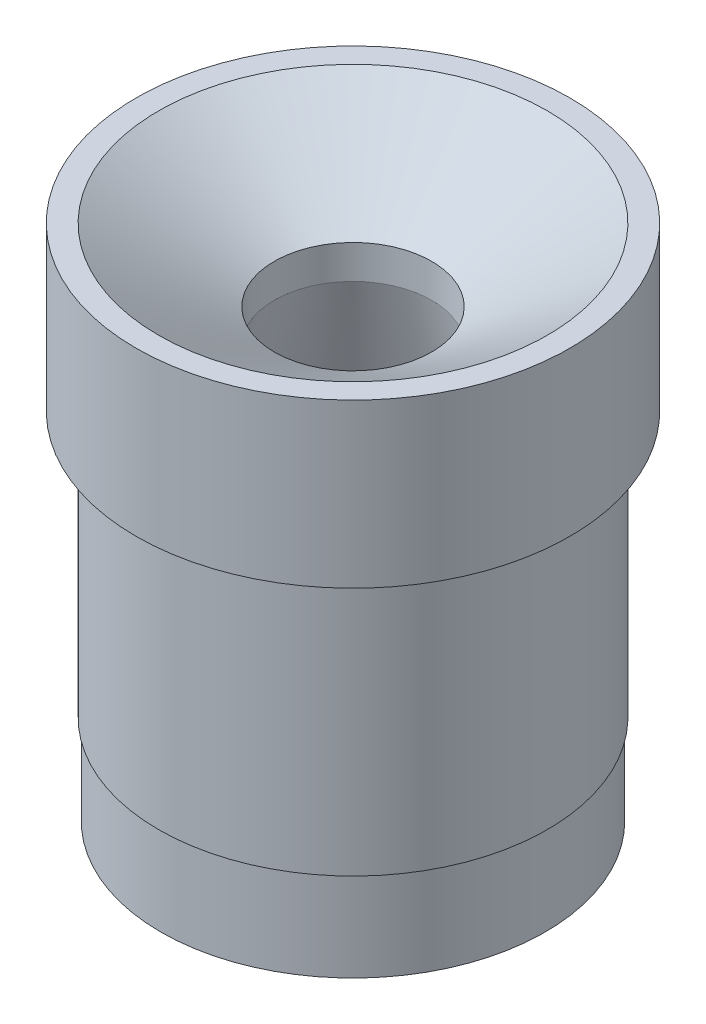
ISO-10303-21;
HEADER;
FILE_DESCRIPTION(('STEP AP214'),'2;1');
FILE_NAME('part.step','',(''),(''),'','','');
FILE_SCHEMA(('AUTOMOTIVE_DESIGN { 1 0 10303 214 1 1 1 1 }'));
ENDSEC;
DATA;
#1=APPLICATION_CONTEXT('core data for automotive mechanical design processes');
#2=APPLICATION_PROTOCOL_DEFINITION('international standard','automotive_design',2000,#1);
#3=PRODUCT_CONTEXT('',#1,'mechanical');
#4=PRODUCT('Part','Part','',(#3));
#5=PRODUCT_RELATED_PRODUCT_CATEGORY('part','',(#4));
#6=PRODUCT_DEFINITION_FORMATION('','',#4);
#7=PRODUCT_DEFINITION_CONTEXT('part definition',#1,'design');
#8=PRODUCT_DEFINITION('design','',#6,#7);
#9=PRODUCT_DEFINITION_SHAPE('','',#8);
#10=(LENGTH_UNIT() NAMED_UNIT(*) SI_UNIT(.MILLI.,.METRE.));
#11=(NAMED_UNIT(*) PLANE_ANGLE_UNIT() SI_UNIT($,.RADIAN.));
#12=(NAMED_UNIT(*) SI_UNIT($,.STERADIAN.) SOLID_ANGLE_UNIT());
#13=UNCERTAINTY_MEASURE_WITH_UNIT(LENGTH_MEASURE(1.E-05),#10,'distance_accuracy_value','');
#14=(GEOMETRIC_REPRESENTATION_CONTEXT(3) GLOBAL_UNCERTAINTY_ASSIGNED_CONTEXT((#13)) GLOBAL_UNIT_ASSIGNED_CONTEXT((#10,
#11,#12)) REPRESENTATION_CONTEXT('',''));
#15=CARTESIAN_POINT('',(0.,0.,0.));
#16=DIRECTION('',(0.,0.,1.));
#17=DIRECTION('',(1.,0.,0.));
#18=AXIS2_PLACEMENT_3D('',#15,#16,#17);
#19=CARTESIAN_POINT('',(0.,0.,-24.511));
#20=DIRECTION('',(0.,1.,0.));
#21=DIRECTION('',(0.,0.,1.));
#22=AXIS2_PLACEMENT_3D('',#19,#20,#21);
#23=PLANE('',#22);
#24=CARTESIAN_POINT('',(0.,0.,0.));
#25=DIRECTION('',(0.,1.,0.));
#26=DIRECTION('',(0.,0.,1.));
#27=AXIS2_PLACEMENT_3D('',#24,#25,#26);
#28=CIRCLE('',#27,24.511);
#29=CARTESIAN_POINT('',(0.,0.,24.511));
#30=VERTEX_POINT('',#29);
#31=EDGE_CURVE('E80',#30,#30,#28,.T.);
#32=ORIENTED_EDGE('',*,*,#31,.F.);
#33=EDGE_LOOP('',(#32));
#34=FACE_BOUND('',#33,.T.);
#35=CARTESIAN_POINT('',(0.,0.,0.));
#36=DIRECTION('',(0.,1.,0.));
#37=DIRECTION('',(0.,0.,1.));
#38=AXIS2_PLACEMENT_3D('',#35,#36,#37);
#39=CIRCLE('',#38,21.971);
#40=CARTESIAN_POINT('',(0.,0.,21.971));
#41=VERTEX_POINT('',#40);
#42=EDGE_CURVE('E10',#41,#41,#39,.T.);
#43=ORIENTED_EDGE('',*,*,#42,.T.);
#44=EDGE_LOOP('',(#43));
#45=FACE_BOUND('',#44,.T.);
#46=ADVANCED_FACE('F37',(#34,#45),#23,.F.);
#47=CARTESIAN_POINT('',(0.,21.55825,0.));
#48=DIRECTION('',(0.,1.,0.));
#49=DIRECTION('',(0.,0.,1.));
#50=AXIS2_PLACEMENT_3D('',#47,#48,#49);
#51=CYLINDRICAL_SURFACE('',#50,21.971);
#52=ORIENTED_EDGE('',*,*,#42,.F.);
#53=EDGE_LOOP('',(#52));
#54=FACE_BOUND('',#53,.T.);
#55=CARTESIAN_POINT('',(0.,-29.972,0.));
#56=DIRECTION('',(0.,1.,0.));
#57=DIRECTION('',(0.,0.,1.));
#58=AXIS2_PLACEMENT_3D('',#55,#56,#57);
#59=CIRCLE('',#58,21.971);
#60=CARTESIAN_POINT('',(0.,-29.972,21.971));
#61=VERTEX_POINT('',#60);
#62=EDGE_CURVE('E44',#61,#61,#59,.T.);
#63=ORIENTED_EDGE('',*,*,#62,.T.);
#64=EDGE_LOOP('',(#63));
#65=FACE_BOUND('',#64,.T.);
#66=ADVANCED_FACE('F88',(#54,#65),#51,.T.);
#67=CARTESIAN_POINT('',(0.,-29.972,-21.717));
#68=DIRECTION('',(0.,1.,0.));
#69=DIRECTION('',(0.,0.,1.));
#70=AXIS2_PLACEMENT_3D('',#67,#68,#69);
#71=PLANE('',#70);
#72=ORIENTED_EDGE('',*,*,#62,.F.);
#73=EDGE_LOOP('',(#72));
#74=FACE_BOUND('',#73,.T.);
#75=CARTESIAN_POINT('',(0.,-29.972,0.));
#76=DIRECTION('',(0.,1.,0.));
#77=DIRECTION('',(0.,0.,1.));
#78=AXIS2_PLACEMENT_3D('',#75,#76,#77);
#79=CIRCLE('',#78,21.717);
#80=CARTESIAN_POINT('',(0.,-29.972,21.717));
#81=VERTEX_POINT('',#80);
#82=EDGE_CURVE('E49',#81,#81,#79,.T.);
#83=ORIENTED_EDGE('',*,*,#82,.T.);
#84=EDGE_LOOP('',(#83));
#85=FACE_BOUND('',#84,.T.);
#86=ADVANCED_FACE('F92',(#74,#85),#71,.F.);
#87=CARTESIAN_POINT('',(0.,21.55825,0.));
#88=DIRECTION('',(0.,1.,0.));
#89=DIRECTION('',(0.,0.,1.));
#90=AXIS2_PLACEMENT_3D('',#87,#88,#89);
#91=CYLINDRICAL_SURFACE('',#90,21.717);
#92=ORIENTED_EDGE('',*,*,#82,.F.);
#93=EDGE_LOOP('',(#92));
#94=FACE_BOUND('',#93,.T.);
#95=CARTESIAN_POINT('',(0.,-40.132,0.));
#96=DIRECTION('',(0.,1.,0.));
#97=DIRECTION('',(0.,0.,1.));
#98=AXIS2_PLACEMENT_3D('',#95,#96,#97);
#99=CIRCLE('',#98,21.717);
#100=CARTESIAN_POINT('',(0.,-40.132,21.717));
#101=VERTEX_POINT('',#100);
#102=EDGE_CURVE('E54',#101,#101,#99,.T.);
#103=ORIENTED_EDGE('',*,*,#102,.T.);
#104=EDGE_LOOP('',(#103));
#105=FACE_BOUND('',#104,.T.);
#106=ADVANCED_FACE('F97',(#94,#105),#91,.T.);
#107=CARTESIAN_POINT('',(0.,-40.132,-21.717));
#108=DIRECTION('',(0.,1.,0.));
#109=DIRECTION('',(0.,0.,1.));
#110=AXIS2_PLACEMENT_3D('',#107,#108,#109);
#111=PLANE('',#110);
#112=ORIENTED_EDGE('',*,*,#102,.F.);
#113=EDGE_LOOP('',(#112));
#114=FACE_BOUND('',#113,.T.);
#115=CARTESIAN_POINT('',(0.,-40.132,0.));
#116=DIRECTION('',(0.,1.,0.));
#117=DIRECTION('',(0.,0.,1.));
#118=AXIS2_PLACEMENT_3D('',#115,#116,#117);
#119=CIRCLE('',#118,20.066);
#120=CARTESIAN_POINT('',(0.,-40.132,20.066));
#121=VERTEX_POINT('',#120);
#122=EDGE_CURVE('E60',#121,#121,#119,.T.);
#123=ORIENTED_EDGE('',*,*,#122,.T.);
#124=EDGE_LOOP('',(#123));
#125=FACE_BOUND('',#124,.T.);
#126=ADVANCED_FACE('F103',(#114,#125),#111,.F.);
#127=CARTESIAN_POINT('',(0.,6.4193902305304,0.));
#128=DIRECTION('',(0.,-1.,0.));
#129=DIRECTION('',(0.,0.,-1.));
#130=AXIS2_PLACEMENT_3D('',#127,#128,#129);
#131=CONICAL_SURFACE('',#130,8.89,0.235619449019235);
#132=ORIENTED_EDGE('',*,*,#122,.F.);
#133=EDGE_LOOP('',(#132));
#134=FACE_BOUND('',#133,.T.);
#135=CARTESIAN_POINT('',(0.,6.4193902305304,0.));
#136=DIRECTION('',(0.,1.,0.));
#137=DIRECTION('',(0.,0.,1.));
#138=AXIS2_PLACEMENT_3D('',#135,#136,#137);
#139=CIRCLE('',#138,8.89);
#140=CARTESIAN_POINT('',(0.,6.4193902305304,8.89));
#141=VERTEX_POINT('',#140);
#142=EDGE_CURVE('E64',#141,#141,#139,.T.);
#143=ORIENTED_EDGE('',*,*,#142,.T.);
#144=EDGE_LOOP('',(#143));
#145=FACE_BOUND('',#144,.T.);
#146=ADVANCED_FACE('F107',(#134,#145),#131,.F.);
#147=CARTESIAN_POINT('',(0.,21.55825,0.));
#148=DIRECTION('',(0.,1.,0.));
#149=DIRECTION('',(0.,0.,1.));
#150=AXIS2_PLACEMENT_3D('',#147,#148,#149);
#151=CYLINDRICAL_SURFACE('',#150,8.89);
#152=ORIENTED_EDGE('',*,*,#142,.F.);
#153=EDGE_LOOP('',(#152));
#154=FACE_BOUND('',#153,.T.);
#155=CARTESIAN_POINT('',(0.,10.2293902305304,0.));
#156=DIRECTION('',(0.,1.,0.));
#157=DIRECTION('',(0.,0.,1.));
#158=AXIS2_PLACEMENT_3D('',#155,#156,#157);
#159=CIRCLE('',#158,8.89);
#160=CARTESIAN_POINT('',(0.,10.2293902305304,8.89));
#161=VERTEX_POINT('',#160);
#162=EDGE_CURVE('E68',#161,#161,#159,.T.);
#163=ORIENTED_EDGE('',*,*,#162,.T.);
#164=EDGE_LOOP('',(#163));
#165=FACE_BOUND('',#164,.T.);
#166=ADVANCED_FACE('F111',(#154,#165),#151,.F.);
#167=CARTESIAN_POINT('',(0.,18.415,0.));
#168=DIRECTION('',(0.,1.,0.));
#169=DIRECTION('',(0.,0.,1.));
#170=AXIS2_PLACEMENT_3D('',#167,#168,#169);
#171=CONICAL_SURFACE('',#170,21.971,1.01164830753766);
#172=ORIENTED_EDGE('',*,*,#162,.F.);
#173=EDGE_LOOP('',(#172));
#174=FACE_BOUND('',#173,.T.);
#175=CARTESIAN_POINT('',(0.,18.415,0.));
#176=DIRECTION('',(0.,1.,0.));
#177=DIRECTION('',(0.,0.,1.));
#178=AXIS2_PLACEMENT_3D('',#175,#176,#177);
#179=CIRCLE('',#178,21.971);
#180=CARTESIAN_POINT('',(0.,18.415,21.971));
#181=VERTEX_POINT('',#180);
#182=EDGE_CURVE('E72',#181,#181,#179,.T.);
#183=ORIENTED_EDGE('',*,*,#182,.T.);
#184=EDGE_LOOP('',(#183));
#185=FACE_BOUND('',#184,.T.);
#186=ADVANCED_FACE('F115',(#174,#185),#171,.F.);
#187=CARTESIAN_POINT('',(0.,18.415,-21.971));
#188=DIRECTION('',(0.,-1.,0.));
#189=DIRECTION('',(0.,0.,-1.));
#190=AXIS2_PLACEMENT_3D('',#187,#188,#189);
#191=PLANE('',#190);
#192=ORIENTED_EDGE('',*,*,#182,.F.);
#193=EDGE_LOOP('',(#192));
#194=FACE_BOUND('',#193,.T.);
#195=CARTESIAN_POINT('',(0.,18.415,0.));
#196=DIRECTION('',(0.,1.,0.));
#197=DIRECTION('',(0.,0.,1.));
#198=AXIS2_PLACEMENT_3D('',#195,#196,#197);
#199=CIRCLE('',#198,24.511);
#200=CARTESIAN_POINT('',(0.,18.415,24.511));
#201=VERTEX_POINT('',#200);
#202=EDGE_CURVE('E76',#201,#201,#199,.T.);
#203=ORIENTED_EDGE('',*,*,#202,.T.);
#204=EDGE_LOOP('',(#203));
#205=FACE_BOUND('',#204,.T.);
#206=ADVANCED_FACE('F119',(#194,#205),#191,.F.);
#207=CARTESIAN_POINT('',(0.,21.55825,0.));
#208=DIRECTION('',(0.,1.,0.));
#209=DIRECTION('',(0.,0.,1.));
#210=AXIS2_PLACEMENT_3D('',#207,#208,#209);
#211=CYLINDRICAL_SURFACE('',#210,24.511);
#212=ORIENTED_EDGE('',*,*,#202,.F.);
#213=EDGE_LOOP('',(#212));
#214=FACE_BOUND('',#213,.T.);
#215=ORIENTED_EDGE('',*,*,#31,.T.);
#216=EDGE_LOOP('',(#215));
#217=FACE_BOUND('',#216,.T.);
#218=ADVANCED_FACE('F85',(#214,#217),#211,.T.);
#219=CLOSED_SHELL('',(#46,#66,#86,#106,#126,#146,#166,#186,#206,#218));
#220=MANIFOLD_SOLID_BREP('B2',#219);
#221=ADVANCED_BREP_SHAPE_REPRESENTATION('',(#18,#220),#14);
#222=SHAPE_DEFINITION_REPRESENTATION(#9,#221);
ENDSEC;
END-ISO-10303-21;
